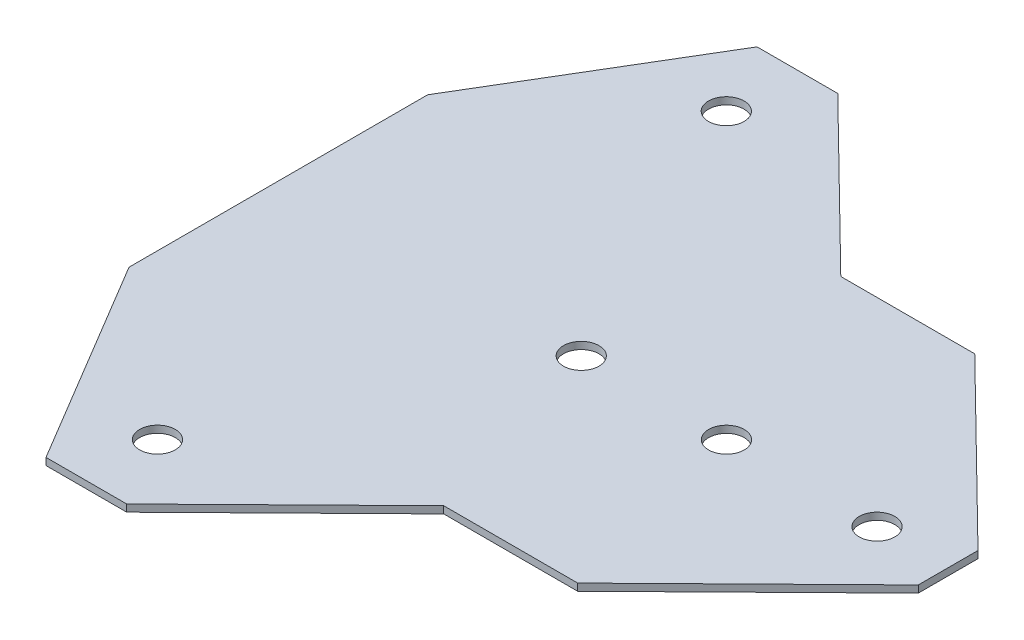
ISO-10303-21;
HEADER;
FILE_DESCRIPTION(('STEP AP214'),'2;1');
FILE_NAME('part.step','',(''),(''),'','','');
FILE_SCHEMA(('AUTOMOTIVE_DESIGN { 1 0 10303 214 1 1 1 1 }'));
ENDSEC;
DATA;
#1=APPLICATION_CONTEXT('core data for automotive mechanical design processes');
#2=APPLICATION_PROTOCOL_DEFINITION('international standard','automotive_design',2000,#1);
#3=PRODUCT_CONTEXT('',#1,'mechanical');
#4=PRODUCT('Part','Part','',(#3));
#5=PRODUCT_RELATED_PRODUCT_CATEGORY('part','',(#4));
#6=PRODUCT_DEFINITION_FORMATION('','',#4);
#7=PRODUCT_DEFINITION_CONTEXT('part definition',#1,'design');
#8=PRODUCT_DEFINITION('design','',#6,#7);
#9=PRODUCT_DEFINITION_SHAPE('','',#8);
#10=(LENGTH_UNIT() NAMED_UNIT(*) SI_UNIT(.MILLI.,.METRE.));
#11=(NAMED_UNIT(*) PLANE_ANGLE_UNIT() SI_UNIT($,.RADIAN.));
#12=(NAMED_UNIT(*) SI_UNIT($,.STERADIAN.) SOLID_ANGLE_UNIT());
#13=UNCERTAINTY_MEASURE_WITH_UNIT(LENGTH_MEASURE(1.E-05),#10,'distance_accuracy_value','');
#14=(GEOMETRIC_REPRESENTATION_CONTEXT(3) GLOBAL_UNCERTAINTY_ASSIGNED_CONTEXT((#13)) GLOBAL_UNIT_ASSIGNED_CONTEXT((#10,
#11,#12)) REPRESENTATION_CONTEXT('',''));
#15=CARTESIAN_POINT('',(0.,0.,0.));
#16=DIRECTION('',(0.,0.,1.));
#17=DIRECTION('',(1.,0.,0.));
#18=AXIS2_PLACEMENT_3D('',#15,#16,#17);
#19=CARTESIAN_POINT('',(28.180948874794,-1.,27.92));
#20=DIRECTION('',(0.,0.,1.));
#21=DIRECTION('',(1.,0.,0.));
#22=AXIS2_PLACEMENT_3D('',#19,#20,#21);
#23=PLANE('',#22);
#24=DIRECTION('',(1.,0.,0.));
#25=VECTOR('',#24,1.);
#26=CARTESIAN_POINT('',(28.180948874794,0.,27.92));
#27=LINE('',#26,#25);
#28=CARTESIAN_POINT('',(28.180948874794,0.,27.92));
#29=VERTEX_POINT('',#28);
#30=CARTESIAN_POINT('',(47.02,0.,27.92));
#31=VERTEX_POINT('',#30);
#32=EDGE_CURVE('E160',#29,#31,#27,.T.);
#33=ORIENTED_EDGE('',*,*,#32,.F.);
#34=DIRECTION('',(0.,1.,0.));
#35=VECTOR('',#34,1.);
#36=CARTESIAN_POINT('',(28.180948874794,-1.,27.92));
#37=LINE('',#36,#35);
#38=CARTESIAN_POINT('',(28.180948874794,-1.,27.92));
#39=VERTEX_POINT('',#38);
#40=EDGE_CURVE('E11',#39,#29,#37,.T.);
#41=ORIENTED_EDGE('',*,*,#40,.F.);
#42=DIRECTION('',(1.,0.,0.));
#43=VECTOR('',#42,1.);
#44=CARTESIAN_POINT('',(28.180948874794,-1.,27.92));
#45=LINE('',#44,#43);
#46=CARTESIAN_POINT('',(47.02,-1.,27.92));
#47=VERTEX_POINT('',#46);
#48=EDGE_CURVE('E193',#39,#47,#45,.T.);
#49=ORIENTED_EDGE('',*,*,#48,.T.);
#50=DIRECTION('',(0.,1.,0.));
#51=VECTOR('',#50,1.);
#52=CARTESIAN_POINT('',(47.02,-1.,27.92));
#53=LINE('',#52,#51);
#54=EDGE_CURVE('E42',#47,#31,#53,.T.);
#55=ORIENTED_EDGE('',*,*,#54,.T.);
#56=EDGE_LOOP('',(#33,#41,#49,#55));
#57=FACE_BOUND('',#56,.T.);
#58=ADVANCED_FACE('F39',(#57),#23,.T.);
#59=CARTESIAN_POINT('',(5.67437627234488,-1.,50.));
#60=DIRECTION('',(0.700309636633643,0.,0.713839206571098));
#61=DIRECTION('',(0.713839206571098,0.,-0.700309636633643));
#62=AXIS2_PLACEMENT_3D('',#59,#60,#61);
#63=PLANE('',#62);
#64=DIRECTION('',(0.713839206571098,0.,-0.700309636633643));
#65=VECTOR('',#64,1.);
#66=CARTESIAN_POINT('',(5.67437627234488,0.,50.));
#67=LINE('',#66,#65);
#68=CARTESIAN_POINT('',(5.67437627234488,0.,50.));
#69=VERTEX_POINT('',#68);
#70=EDGE_CURVE('E191',#69,#29,#67,.T.);
#71=ORIENTED_EDGE('',*,*,#70,.F.);
#72=DIRECTION('',(0.,1.,0.));
#73=VECTOR('',#72,1.);
#74=CARTESIAN_POINT('',(5.67437627234488,-1.,50.));
#75=LINE('',#74,#73);
#76=CARTESIAN_POINT('',(5.67437627234488,-1.,50.));
#77=VERTEX_POINT('',#76);
#78=EDGE_CURVE('E48',#77,#69,#75,.T.);
#79=ORIENTED_EDGE('',*,*,#78,.F.);
#80=DIRECTION('',(0.713839206571098,0.,-0.700309636633643));
#81=VECTOR('',#80,1.);
#82=CARTESIAN_POINT('',(5.67437627234488,-1.,50.));
#83=LINE('',#82,#81);
#84=EDGE_CURVE('E150',#77,#39,#83,.T.);
#85=ORIENTED_EDGE('',*,*,#84,.T.);
#86=ORIENTED_EDGE('',*,*,#40,.T.);
#87=EDGE_LOOP('',(#71,#79,#85,#86));
#88=FACE_BOUND('',#87,.T.);
#89=ADVANCED_FACE('F213',(#88),#63,.T.);
#90=CARTESIAN_POINT('',(-5.67437627234488,-1.,50.));
#91=DIRECTION('',(0.,0.,1.));
#92=DIRECTION('',(1.,0.,0.));
#93=AXIS2_PLACEMENT_3D('',#90,#91,#92);
#94=PLANE('',#93);
#95=DIRECTION('',(1.,0.,0.));
#96=VECTOR('',#95,1.);
#97=CARTESIAN_POINT('',(-5.67437627234488,0.,50.));
#98=LINE('',#97,#96);
#99=CARTESIAN_POINT('',(-5.67437627234488,0.,50.));
#100=VERTEX_POINT('',#99);
#101=EDGE_CURVE('E137',#100,#69,#98,.T.);
#102=ORIENTED_EDGE('',*,*,#101,.F.);
#103=DIRECTION('',(0.,1.,0.));
#104=VECTOR('',#103,1.);
#105=CARTESIAN_POINT('',(-5.67437627234488,-1.,50.));
#106=LINE('',#105,#104);
#107=CARTESIAN_POINT('',(-5.67437627234488,-1.,50.));
#108=VERTEX_POINT('',#107);
#109=EDGE_CURVE('E132',#108,#100,#106,.T.);
#110=ORIENTED_EDGE('',*,*,#109,.F.);
#111=DIRECTION('',(1.,0.,0.));
#112=VECTOR('',#111,1.);
#113=CARTESIAN_POINT('',(-5.67437627234488,-1.,50.));
#114=LINE('',#113,#112);
#115=EDGE_CURVE('E135',#108,#77,#114,.T.);
#116=ORIENTED_EDGE('',*,*,#115,.T.);
#117=ORIENTED_EDGE('',*,*,#78,.T.);
#118=EDGE_LOOP('',(#102,#110,#116,#117));
#119=FACE_BOUND('',#118,.T.);
#120=ADVANCED_FACE('F134',(#119),#94,.T.);
#121=CARTESIAN_POINT('',(-23.,-1.,21.));
#122=DIRECTION('',(-0.858462735120334,0.,0.512875942514089));
#123=DIRECTION('',(0.512875942514089,0.,0.858462735120334));
#124=AXIS2_PLACEMENT_3D('',#121,#122,#123);
#125=PLANE('',#124);
#126=DIRECTION('',(0.512875942514089,0.,0.858462735120334));
#127=VECTOR('',#126,1.);
#128=CARTESIAN_POINT('',(-23.,0.,21.));
#129=LINE('',#128,#127);
#130=CARTESIAN_POINT('',(-23.,0.,21.));
#131=VERTEX_POINT('',#130);
#132=EDGE_CURVE('E188',#131,#100,#129,.T.);
#133=ORIENTED_EDGE('',*,*,#132,.F.);
#134=DIRECTION('',(0.,1.,0.));
#135=VECTOR('',#134,1.);
#136=CARTESIAN_POINT('',(-23.,-1.,21.));
#137=LINE('',#136,#135);
#138=CARTESIAN_POINT('',(-23.,-1.,21.));
#139=VERTEX_POINT('',#138);
#140=EDGE_CURVE('E142',#139,#131,#137,.T.);
#141=ORIENTED_EDGE('',*,*,#140,.F.);
#142=DIRECTION('',(0.512875942514089,0.,0.858462735120334));
#143=VECTOR('',#142,1.);
#144=CARTESIAN_POINT('',(-23.,-1.,21.));
#145=LINE('',#144,#143);
#146=EDGE_CURVE('E148',#139,#108,#145,.T.);
#147=ORIENTED_EDGE('',*,*,#146,.T.);
#148=ORIENTED_EDGE('',*,*,#109,.T.);
#149=EDGE_LOOP('',(#133,#141,#147,#148));
#150=FACE_BOUND('',#149,.T.);
#151=ADVANCED_FACE('F152',(#150),#125,.T.);
#152=CARTESIAN_POINT('',(-23.,-1.,-21.));
#153=DIRECTION('',(-1.,0.,0.));
#154=DIRECTION('',(0.,0.,1.));
#155=AXIS2_PLACEMENT_3D('',#152,#153,#154);
#156=PLANE('',#155);
#157=DIRECTION('',(0.,0.,1.));
#158=VECTOR('',#157,1.);
#159=CARTESIAN_POINT('',(-23.,0.,-21.));
#160=LINE('',#159,#158);
#161=CARTESIAN_POINT('',(-23.,0.,-21.));
#162=VERTEX_POINT('',#161);
#163=EDGE_CURVE('E185',#162,#131,#160,.T.);
#164=ORIENTED_EDGE('',*,*,#163,.F.);
#165=DIRECTION('',(0.,1.,0.));
#166=VECTOR('',#165,1.);
#167=CARTESIAN_POINT('',(-23.,-1.,-21.));
#168=LINE('',#167,#166);
#169=CARTESIAN_POINT('',(-23.,-1.,-21.));
#170=VERTEX_POINT('',#169);
#171=EDGE_CURVE('E197',#170,#162,#168,.T.);
#172=ORIENTED_EDGE('',*,*,#171,.F.);
#173=DIRECTION('',(0.,0.,1.));
#174=VECTOR('',#173,1.);
#175=CARTESIAN_POINT('',(-23.,-1.,-21.));
#176=LINE('',#175,#174);
#177=EDGE_CURVE('E153',#170,#139,#176,.T.);
#178=ORIENTED_EDGE('',*,*,#177,.T.);
#179=ORIENTED_EDGE('',*,*,#140,.T.);
#180=EDGE_LOOP('',(#164,#172,#178,#179));
#181=FACE_BOUND('',#180,.T.);
#182=ADVANCED_FACE('F226',(#181),#156,.T.);
#183=CARTESIAN_POINT('',(-23.,-1.,-21.));
#184=DIRECTION('',(-0.858462735120334,0.,-0.512875942514089));
#185=DIRECTION('',(-0.512875942514089,0.,0.858462735120334));
#186=AXIS2_PLACEMENT_3D('',#183,#184,#185);
#187=PLANE('',#186);
#188=DIRECTION('',(-0.512875942514089,0.,0.858462735120334));
#189=VECTOR('',#188,1.);
#190=CARTESIAN_POINT('',(-23.,0.,-21.));
#191=LINE('',#190,#189);
#192=CARTESIAN_POINT('',(-5.67437627234488,0.,-50.));
#193=VERTEX_POINT('',#192);
#194=EDGE_CURVE('E182',#193,#162,#191,.T.);
#195=ORIENTED_EDGE('',*,*,#194,.F.);
#196=DIRECTION('',(0.,1.,0.));
#197=VECTOR('',#196,1.);
#198=CARTESIAN_POINT('',(-5.67437627234488,-1.,-50.));
#199=LINE('',#198,#197);
#200=CARTESIAN_POINT('',(-5.67437627234488,-1.,-50.));
#201=VERTEX_POINT('',#200);
#202=EDGE_CURVE('E199',#201,#193,#199,.T.);
#203=ORIENTED_EDGE('',*,*,#202,.F.);
#204=DIRECTION('',(-0.512875942514089,0.,0.858462735120334));
#205=VECTOR('',#204,1.);
#206=CARTESIAN_POINT('',(-23.,-1.,-21.));
#207=LINE('',#206,#205);
#208=EDGE_CURVE('E155',#201,#170,#207,.T.);
#209=ORIENTED_EDGE('',*,*,#208,.T.);
#210=ORIENTED_EDGE('',*,*,#171,.T.);
#211=EDGE_LOOP('',(#195,#203,#209,#210));
#212=FACE_BOUND('',#211,.T.);
#213=ADVANCED_FACE('F229',(#212),#187,.T.);
#214=CARTESIAN_POINT('',(-5.67437627234488,-1.,-50.));
#215=DIRECTION('',(0.,0.,-1.));
#216=DIRECTION('',(-1.,0.,0.));
#217=AXIS2_PLACEMENT_3D('',#214,#215,#216);
#218=PLANE('',#217);
#219=DIRECTION('',(-1.,0.,0.));
#220=VECTOR('',#219,1.);
#221=CARTESIAN_POINT('',(-5.67437627234488,0.,-50.));
#222=LINE('',#221,#220);
#223=CARTESIAN_POINT('',(5.67437627234488,0.,-50.));
#224=VERTEX_POINT('',#223);
#225=EDGE_CURVE('E179',#224,#193,#222,.T.);
#226=ORIENTED_EDGE('',*,*,#225,.F.);
#227=DIRECTION('',(0.,1.,0.));
#228=VECTOR('',#227,1.);
#229=CARTESIAN_POINT('',(5.67437627234488,-1.,-50.));
#230=LINE('',#229,#228);
#231=CARTESIAN_POINT('',(5.67437627234488,-1.,-50.));
#232=VERTEX_POINT('',#231);
#233=EDGE_CURVE('E201',#232,#224,#230,.T.);
#234=ORIENTED_EDGE('',*,*,#233,.F.);
#235=DIRECTION('',(-1.,0.,0.));
#236=VECTOR('',#235,1.);
#237=CARTESIAN_POINT('',(-5.67437627234488,-1.,-50.));
#238=LINE('',#237,#236);
#239=EDGE_CURVE('E333',#232,#201,#238,.T.);
#240=ORIENTED_EDGE('',*,*,#239,.T.);
#241=ORIENTED_EDGE('',*,*,#202,.T.);
#242=EDGE_LOOP('',(#226,#234,#240,#241));
#243=FACE_BOUND('',#242,.T.);
#244=ADVANCED_FACE('F233',(#243),#218,.T.);
#245=CARTESIAN_POINT('',(5.67437627234488,-1.,-50.));
#246=DIRECTION('',(0.700309636633643,0.,-0.713839206571098));
#247=DIRECTION('',(-0.713839206571098,0.,-0.700309636633643));
#248=AXIS2_PLACEMENT_3D('',#245,#246,#247);
#249=PLANE('',#248);
#250=DIRECTION('',(-0.713839206571098,0.,-0.700309636633643));
#251=VECTOR('',#250,1.);
#252=CARTESIAN_POINT('',(5.67437627234488,0.,-50.));
#253=LINE('',#252,#251);
#254=CARTESIAN_POINT('',(28.180948874794,0.,-27.92));
#255=VERTEX_POINT('',#254);
#256=EDGE_CURVE('E176',#255,#224,#253,.T.);
#257=ORIENTED_EDGE('',*,*,#256,.F.);
#258=DIRECTION('',(0.,1.,0.));
#259=VECTOR('',#258,1.);
#260=CARTESIAN_POINT('',(28.180948874794,-1.,-27.92));
#261=LINE('',#260,#259);
#262=CARTESIAN_POINT('',(28.180948874794,-1.,-27.92));
#263=VERTEX_POINT('',#262);
#264=EDGE_CURVE('E203',#263,#255,#261,.T.);
#265=ORIENTED_EDGE('',*,*,#264,.F.);
#266=DIRECTION('',(-0.713839206571098,0.,-0.700309636633643));
#267=VECTOR('',#266,1.);
#268=CARTESIAN_POINT('',(5.67437627234488,-1.,-50.));
#269=LINE('',#268,#267);
#270=EDGE_CURVE('E330',#263,#232,#269,.T.);
#271=ORIENTED_EDGE('',*,*,#270,.T.);
#272=ORIENTED_EDGE('',*,*,#233,.T.);
#273=EDGE_LOOP('',(#257,#265,#271,#272));
#274=FACE_BOUND('',#273,.T.);
#275=ADVANCED_FACE('F237',(#274),#249,.T.);
#276=CARTESIAN_POINT('',(28.180948874794,-1.,-27.92));
#277=DIRECTION('',(0.,0.,-1.));
#278=DIRECTION('',(-1.,0.,0.));
#279=AXIS2_PLACEMENT_3D('',#276,#277,#278);
#280=PLANE('',#279);
#281=DIRECTION('',(-1.,0.,0.));
#282=VECTOR('',#281,1.);
#283=CARTESIAN_POINT('',(28.180948874794,0.,-27.92));
#284=LINE('',#283,#282);
#285=CARTESIAN_POINT('',(47.02,0.,-27.92));
#286=VERTEX_POINT('',#285);
#287=EDGE_CURVE('E173',#286,#255,#284,.T.);
#288=ORIENTED_EDGE('',*,*,#287,.F.);
#289=DIRECTION('',(0.,1.,0.));
#290=VECTOR('',#289,1.);
#291=CARTESIAN_POINT('',(47.02,-1.,-27.92));
#292=LINE('',#291,#290);
#293=CARTESIAN_POINT('',(47.02,-1.,-27.92));
#294=VERTEX_POINT('',#293);
#295=EDGE_CURVE('E205',#294,#286,#292,.T.);
#296=ORIENTED_EDGE('',*,*,#295,.F.);
#297=DIRECTION('',(-1.,0.,0.));
#298=VECTOR('',#297,1.);
#299=CARTESIAN_POINT('',(28.180948874794,-1.,-27.92));
#300=LINE('',#299,#298);
#301=EDGE_CURVE('E327',#294,#263,#300,.T.);
#302=ORIENTED_EDGE('',*,*,#301,.T.);
#303=ORIENTED_EDGE('',*,*,#264,.T.);
#304=EDGE_LOOP('',(#288,#296,#302,#303));
#305=FACE_BOUND('',#304,.T.);
#306=ADVANCED_FACE('F241',(#305),#280,.T.);
#307=CARTESIAN_POINT('',(47.02,-1.,-27.92));
#308=DIRECTION('',(0.700309636633643,0.,-0.713839206571098));
#309=DIRECTION('',(-0.713839206571098,0.,-0.700309636633643));
#310=AXIS2_PLACEMENT_3D('',#307,#308,#309);
#311=PLANE('',#310);
#312=DIRECTION('',(-0.713839206571098,0.,-0.700309636633643));
#313=VECTOR('',#312,1.);
#314=CARTESIAN_POINT('',(47.02,0.,-27.92));
#315=LINE('',#314,#313);
#316=CARTESIAN_POINT('',(71.2,0.,-4.19828948322842));
#317=VERTEX_POINT('',#316);
#318=EDGE_CURVE('E170',#317,#286,#315,.T.);
#319=ORIENTED_EDGE('',*,*,#318,.F.);
#320=DIRECTION('',(0.,1.,0.));
#321=VECTOR('',#320,1.);
#322=CARTESIAN_POINT('',(71.2,-1.,-4.19828948322842));
#323=LINE('',#322,#321);
#324=CARTESIAN_POINT('',(71.2,-1.,-4.19828948322842));
#325=VERTEX_POINT('',#324);
#326=EDGE_CURVE('E207',#325,#317,#323,.T.);
#327=ORIENTED_EDGE('',*,*,#326,.F.);
#328=DIRECTION('',(-0.713839206571098,0.,-0.700309636633643));
#329=VECTOR('',#328,1.);
#330=CARTESIAN_POINT('',(47.02,-1.,-27.92));
#331=LINE('',#330,#329);
#332=EDGE_CURVE('E324',#325,#294,#331,.T.);
#333=ORIENTED_EDGE('',*,*,#332,.T.);
#334=ORIENTED_EDGE('',*,*,#295,.T.);
#335=EDGE_LOOP('',(#319,#327,#333,#334));
#336=FACE_BOUND('',#335,.T.);
#337=ADVANCED_FACE('F245',(#336),#311,.T.);
#338=CARTESIAN_POINT('',(71.2,-1.,-4.19828948322842));
#339=DIRECTION('',(1.,0.,0.));
#340=DIRECTION('',(0.,0.,-1.));
#341=AXIS2_PLACEMENT_3D('',#338,#339,#340);
#342=PLANE('',#341);
#343=DIRECTION('',(0.,0.,-1.));
#344=VECTOR('',#343,1.);
#345=CARTESIAN_POINT('',(71.2,0.,-4.19828948322842));
#346=LINE('',#345,#344);
#347=CARTESIAN_POINT('',(71.2,0.,4.19828948322842));
#348=VERTEX_POINT('',#347);
#349=EDGE_CURVE('E167',#348,#317,#346,.T.);
#350=ORIENTED_EDGE('',*,*,#349,.F.);
#351=DIRECTION('',(0.,1.,0.));
#352=VECTOR('',#351,1.);
#353=CARTESIAN_POINT('',(71.2,-1.,4.19828948322842));
#354=LINE('',#353,#352);
#355=CARTESIAN_POINT('',(71.2,-1.,4.19828948322842));
#356=VERTEX_POINT('',#355);
#357=EDGE_CURVE('E208',#356,#348,#354,.T.);
#358=ORIENTED_EDGE('',*,*,#357,.F.);
#359=DIRECTION('',(0.,0.,-1.));
#360=VECTOR('',#359,1.);
#361=CARTESIAN_POINT('',(71.2,-1.,-4.19828948322842));
#362=LINE('',#361,#360);
#363=EDGE_CURVE('E321',#356,#325,#362,.T.);
#364=ORIENTED_EDGE('',*,*,#363,.T.);
#365=ORIENTED_EDGE('',*,*,#326,.T.);
#366=EDGE_LOOP('',(#350,#358,#364,#365));
#367=FACE_BOUND('',#366,.T.);
#368=ADVANCED_FACE('F249',(#367),#342,.T.);
#369=CARTESIAN_POINT('',(47.02,-1.,27.92));
#370=DIRECTION('',(0.700309636633643,0.,0.713839206571098));
#371=DIRECTION('',(0.713839206571098,0.,-0.700309636633643));
#372=AXIS2_PLACEMENT_3D('',#369,#370,#371);
#373=PLANE('',#372);
#374=DIRECTION('',(0.713839206571098,0.,-0.700309636633643));
#375=VECTOR('',#374,1.);
#376=CARTESIAN_POINT('',(47.02,0.,27.92));
#377=LINE('',#376,#375);
#378=EDGE_CURVE('E163',#31,#348,#377,.T.);
#379=ORIENTED_EDGE('',*,*,#378,.F.);
#380=ORIENTED_EDGE('',*,*,#54,.F.);
#381=DIRECTION('',(0.713839206571098,0.,-0.700309636633643));
#382=VECTOR('',#381,1.);
#383=CARTESIAN_POINT('',(47.02,-1.,27.92));
#384=LINE('',#383,#382);
#385=EDGE_CURVE('E319',#47,#356,#384,.T.);
#386=ORIENTED_EDGE('',*,*,#385,.T.);
#387=ORIENTED_EDGE('',*,*,#357,.T.);
#388=EDGE_LOOP('',(#379,#380,#386,#387));
#389=FACE_BOUND('',#388,.T.);
#390=ADVANCED_FACE('F210',(#389),#373,.T.);
#391=CARTESIAN_POINT('',(0.,-1.,0.));
#392=DIRECTION('',(0.,-1.,0.));
#393=DIRECTION('',(0.,0.,-1.));
#394=AXIS2_PLACEMENT_3D('',#391,#392,#393);
#395=PLANE('',#394);
#396=CARTESIAN_POINT('',(40.02,-1.,0.));
#397=DIRECTION('',(0.,1.,0.));
#398=DIRECTION('',(0.,0.,1.));
#399=AXIS2_PLACEMENT_3D('',#396,#397,#398);
#400=CIRCLE('',#399,2.5);
#401=CARTESIAN_POINT('',(40.02,-1.,2.5));
#402=VERTEX_POINT('',#401);
#403=EDGE_CURVE('E288',#402,#402,#400,.T.);
#404=ORIENTED_EDGE('',*,*,#403,.T.);
#405=EDGE_LOOP('',(#404));
#406=FACE_BOUND('',#405,.T.);
#407=CARTESIAN_POINT('',(19.6,-1.,0.));
#408=DIRECTION('',(0.,1.,0.));
#409=DIRECTION('',(0.,0.,1.));
#410=AXIS2_PLACEMENT_3D('',#407,#408,#409);
#411=CIRCLE('',#410,2.5);
#412=CARTESIAN_POINT('',(19.6,-1.,2.5));
#413=VERTEX_POINT('',#412);
#414=EDGE_CURVE('E296',#413,#413,#411,.T.);
#415=ORIENTED_EDGE('',*,*,#414,.T.);
#416=EDGE_LOOP('',(#415));
#417=FACE_BOUND('',#416,.T.);
#418=CARTESIAN_POINT('',(61.2,-1.,0.));
#419=DIRECTION('',(0.,1.,0.));
#420=DIRECTION('',(0.,0.,1.));
#421=AXIS2_PLACEMENT_3D('',#418,#419,#420);
#422=CIRCLE('',#421,2.5);
#423=CARTESIAN_POINT('',(61.2,-1.,2.49999999999998));
#424=VERTEX_POINT('',#423);
#425=EDGE_CURVE('E302',#424,#424,#422,.T.);
#426=ORIENTED_EDGE('',*,*,#425,.T.);
#427=EDGE_LOOP('',(#426));
#428=FACE_BOUND('',#427,.T.);
#429=CARTESIAN_POINT('',(0.,-1.,40.));
#430=DIRECTION('',(0.,1.,0.));
#431=DIRECTION('',(0.,0.,-1.));
#432=AXIS2_PLACEMENT_3D('',#429,#430,#431);
#433=CIRCLE('',#432,2.50000000000002);
#434=CARTESIAN_POINT('',(0.,-1.,37.5));
#435=VERTEX_POINT('',#434);
#436=EDGE_CURVE('E308',#435,#435,#433,.T.);
#437=ORIENTED_EDGE('',*,*,#436,.T.);
#438=EDGE_LOOP('',(#437));
#439=FACE_BOUND('',#438,.T.);
#440=CARTESIAN_POINT('',(0.,-1.,-40.));
#441=DIRECTION('',(0.,1.,0.));
#442=DIRECTION('',(0.,0.,1.));
#443=AXIS2_PLACEMENT_3D('',#440,#441,#442);
#444=CIRCLE('',#443,2.50000000000002);
#445=CARTESIAN_POINT('',(0.,-1.,-37.5));
#446=VERTEX_POINT('',#445);
#447=EDGE_CURVE('E164',#446,#446,#444,.T.);
#448=ORIENTED_EDGE('',*,*,#447,.T.);
#449=EDGE_LOOP('',(#448));
#450=FACE_BOUND('',#449,.T.);
#451=ORIENTED_EDGE('',*,*,#48,.F.);
#452=ORIENTED_EDGE('',*,*,#84,.F.);
#453=ORIENTED_EDGE('',*,*,#115,.F.);
#454=ORIENTED_EDGE('',*,*,#146,.F.);
#455=ORIENTED_EDGE('',*,*,#177,.F.);
#456=ORIENTED_EDGE('',*,*,#208,.F.);
#457=ORIENTED_EDGE('',*,*,#239,.F.);
#458=ORIENTED_EDGE('',*,*,#270,.F.);
#459=ORIENTED_EDGE('',*,*,#301,.F.);
#460=ORIENTED_EDGE('',*,*,#332,.F.);
#461=ORIENTED_EDGE('',*,*,#363,.F.);
#462=ORIENTED_EDGE('',*,*,#385,.F.);
#463=EDGE_LOOP('',(#451,#452,#453,#454,#455,#456,#457,#458,#459,#460,#461,#462));
#464=FACE_BOUND('',#463,.T.);
#465=ADVANCED_FACE('F146',(#406,#417,#428,#439,#450,#464),#395,.T.);
#466=CARTESIAN_POINT('',(0.,0.,0.));
#467=DIRECTION('',(0.,-1.,0.));
#468=DIRECTION('',(0.,0.,-1.));
#469=AXIS2_PLACEMENT_3D('',#466,#467,#468);
#470=PLANE('',#469);
#471=CARTESIAN_POINT('',(40.02,0.,0.));
#472=DIRECTION('',(0.,1.,0.));
#473=DIRECTION('',(0.,0.,1.));
#474=AXIS2_PLACEMENT_3D('',#471,#472,#473);
#475=CIRCLE('',#474,2.5);
#476=CARTESIAN_POINT('',(40.02,0.,2.5));
#477=VERTEX_POINT('',#476);
#478=EDGE_CURVE('E291',#477,#477,#475,.T.);
#479=ORIENTED_EDGE('',*,*,#478,.F.);
#480=EDGE_LOOP('',(#479));
#481=FACE_BOUND('',#480,.T.);
#482=CARTESIAN_POINT('',(19.6,0.,0.));
#483=DIRECTION('',(0.,1.,0.));
#484=DIRECTION('',(0.,0.,1.));
#485=AXIS2_PLACEMENT_3D('',#482,#483,#484);
#486=CIRCLE('',#485,2.5);
#487=CARTESIAN_POINT('',(19.6,0.,2.5));
#488=VERTEX_POINT('',#487);
#489=EDGE_CURVE('E293',#488,#488,#486,.T.);
#490=ORIENTED_EDGE('',*,*,#489,.F.);
#491=EDGE_LOOP('',(#490));
#492=FACE_BOUND('',#491,.T.);
#493=CARTESIAN_POINT('',(61.2,0.,0.));
#494=DIRECTION('',(0.,1.,0.));
#495=DIRECTION('',(0.,0.,1.));
#496=AXIS2_PLACEMENT_3D('',#493,#494,#495);
#497=CIRCLE('',#496,2.5);
#498=CARTESIAN_POINT('',(61.2,0.,2.49999999999998));
#499=VERTEX_POINT('',#498);
#500=EDGE_CURVE('E299',#499,#499,#497,.T.);
#501=ORIENTED_EDGE('',*,*,#500,.F.);
#502=EDGE_LOOP('',(#501));
#503=FACE_BOUND('',#502,.T.);
#504=CARTESIAN_POINT('',(0.,0.,40.));
#505=DIRECTION('',(0.,1.,0.));
#506=DIRECTION('',(0.,0.,-1.));
#507=AXIS2_PLACEMENT_3D('',#504,#505,#506);
#508=CIRCLE('',#507,2.50000000000002);
#509=CARTESIAN_POINT('',(0.,0.,37.5));
#510=VERTEX_POINT('',#509);
#511=EDGE_CURVE('E305',#510,#510,#508,.T.);
#512=ORIENTED_EDGE('',*,*,#511,.F.);
#513=EDGE_LOOP('',(#512));
#514=FACE_BOUND('',#513,.T.);
#515=CARTESIAN_POINT('',(0.,0.,-40.));
#516=DIRECTION('',(0.,1.,0.));
#517=DIRECTION('',(0.,0.,1.));
#518=AXIS2_PLACEMENT_3D('',#515,#516,#517);
#519=CIRCLE('',#518,2.50000000000002);
#520=CARTESIAN_POINT('',(0.,0.,-37.5));
#521=VERTEX_POINT('',#520);
#522=EDGE_CURVE('E311',#521,#521,#519,.T.);
#523=ORIENTED_EDGE('',*,*,#522,.F.);
#524=EDGE_LOOP('',(#523));
#525=FACE_BOUND('',#524,.T.);
#526=ORIENTED_EDGE('',*,*,#32,.T.);
#527=ORIENTED_EDGE('',*,*,#378,.T.);
#528=ORIENTED_EDGE('',*,*,#349,.T.);
#529=ORIENTED_EDGE('',*,*,#318,.T.);
#530=ORIENTED_EDGE('',*,*,#287,.T.);
#531=ORIENTED_EDGE('',*,*,#256,.T.);
#532=ORIENTED_EDGE('',*,*,#225,.T.);
#533=ORIENTED_EDGE('',*,*,#194,.T.);
#534=ORIENTED_EDGE('',*,*,#163,.T.);
#535=ORIENTED_EDGE('',*,*,#132,.T.);
#536=ORIENTED_EDGE('',*,*,#101,.T.);
#537=ORIENTED_EDGE('',*,*,#70,.T.);
#538=EDGE_LOOP('',(#526,#527,#528,#529,#530,#531,#532,#533,#534,#535,#536,#537));
#539=FACE_BOUND('',#538,.T.);
#540=ADVANCED_FACE('F212',(#481,#492,#503,#514,#525,#539),#470,.F.);
#541=CARTESIAN_POINT('',(0.,-1.,-40.));
#542=DIRECTION('',(0.,1.,0.));
#543=DIRECTION('',(0.,0.,1.));
#544=AXIS2_PLACEMENT_3D('',#541,#542,#543);
#545=CYLINDRICAL_SURFACE('',#544,2.50000000000002);
#546=ORIENTED_EDGE('',*,*,#447,.F.);
#547=EDGE_LOOP('',(#546));
#548=FACE_BOUND('',#547,.T.);
#549=ORIENTED_EDGE('',*,*,#522,.T.);
#550=EDGE_LOOP('',(#549));
#551=FACE_BOUND('',#550,.T.);
#552=ADVANCED_FACE('F261',(#548,#551),#545,.F.);
#553=CARTESIAN_POINT('',(0.,-1.,40.));
#554=DIRECTION('',(0.,1.,0.));
#555=DIRECTION('',(0.,0.,1.));
#556=AXIS2_PLACEMENT_3D('',#553,#554,#555);
#557=CYLINDRICAL_SURFACE('',#556,2.50000000000002);
#558=ORIENTED_EDGE('',*,*,#436,.F.);
#559=EDGE_LOOP('',(#558));
#560=FACE_BOUND('',#559,.T.);
#561=ORIENTED_EDGE('',*,*,#511,.T.);
#562=EDGE_LOOP('',(#561));
#563=FACE_BOUND('',#562,.T.);
#564=ADVANCED_FACE('F268',(#560,#563),#557,.F.);
#565=CARTESIAN_POINT('',(61.2,-1.,0.));
#566=DIRECTION('',(0.,1.,0.));
#567=DIRECTION('',(0.,0.,1.));
#568=AXIS2_PLACEMENT_3D('',#565,#566,#567);
#569=CYLINDRICAL_SURFACE('',#568,2.5);
#570=ORIENTED_EDGE('',*,*,#425,.F.);
#571=EDGE_LOOP('',(#570));
#572=FACE_BOUND('',#571,.T.);
#573=ORIENTED_EDGE('',*,*,#500,.T.);
#574=EDGE_LOOP('',(#573));
#575=FACE_BOUND('',#574,.T.);
#576=ADVANCED_FACE('F272',(#572,#575),#569,.F.);
#577=CARTESIAN_POINT('',(19.6,-1.,0.));
#578=DIRECTION('',(0.,1.,0.));
#579=DIRECTION('',(0.,0.,1.));
#580=AXIS2_PLACEMENT_3D('',#577,#578,#579);
#581=CYLINDRICAL_SURFACE('',#580,2.5);
#582=ORIENTED_EDGE('',*,*,#414,.F.);
#583=EDGE_LOOP('',(#582));
#584=FACE_BOUND('',#583,.T.);
#585=ORIENTED_EDGE('',*,*,#489,.T.);
#586=EDGE_LOOP('',(#585));
#587=FACE_BOUND('',#586,.T.);
#588=ADVANCED_FACE('F276',(#584,#587),#581,.F.);
#589=CARTESIAN_POINT('',(40.02,-1.,0.));
#590=DIRECTION('',(0.,1.,0.));
#591=DIRECTION('',(0.,0.,1.));
#592=AXIS2_PLACEMENT_3D('',#589,#590,#591);
#593=CYLINDRICAL_SURFACE('',#592,2.5);
#594=ORIENTED_EDGE('',*,*,#403,.F.);
#595=EDGE_LOOP('',(#594));
#596=FACE_BOUND('',#595,.T.);
#597=ORIENTED_EDGE('',*,*,#478,.T.);
#598=EDGE_LOOP('',(#597));
#599=FACE_BOUND('',#598,.T.);
#600=ADVANCED_FACE('F280',(#596,#599),#593,.F.);
#601=CLOSED_SHELL('',(#58,#89,#120,#151,#182,#213,#244,#275,#306,#337,#368,#390,#465,#540,#552,
#564,#576,#588,#600));
#602=MANIFOLD_SOLID_BREP('B2',#601);
#603=ADVANCED_BREP_SHAPE_REPRESENTATION('',(#18,#602),#14);
#604=SHAPE_DEFINITION_REPRESENTATION(#9,#603);
ENDSEC;
END-ISO-10303-21;
